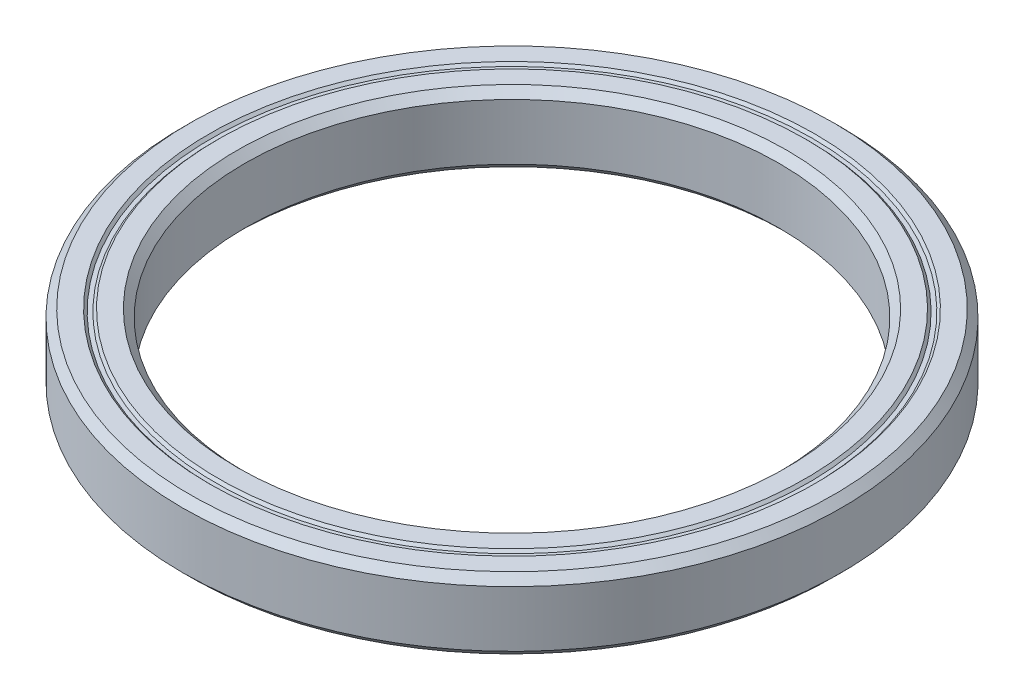
ISO-10303-21;
HEADER;
FILE_DESCRIPTION(('STEP AP214'),'2;1');
FILE_NAME('part.step','',(''),(''),'','','');
FILE_SCHEMA(('AUTOMOTIVE_DESIGN { 1 0 10303 214 1 1 1 1 }'));
ENDSEC;
DATA;
#1=APPLICATION_CONTEXT('core data for automotive mechanical design processes');
#2=APPLICATION_PROTOCOL_DEFINITION('international standard','automotive_design',2000,#1);
#3=PRODUCT_CONTEXT('',#1,'mechanical');
#4=PRODUCT('Part','Part','',(#3));
#5=PRODUCT_RELATED_PRODUCT_CATEGORY('part','',(#4));
#6=PRODUCT_DEFINITION_FORMATION('','',#4);
#7=PRODUCT_DEFINITION_CONTEXT('part definition',#1,'design');
#8=PRODUCT_DEFINITION('design','',#6,#7);
#9=PRODUCT_DEFINITION_SHAPE('','',#8);
#10=(LENGTH_UNIT() NAMED_UNIT(*) SI_UNIT(.MILLI.,.METRE.));
#11=(NAMED_UNIT(*) PLANE_ANGLE_UNIT() SI_UNIT($,.RADIAN.));
#12=(NAMED_UNIT(*) SI_UNIT($,.STERADIAN.) SOLID_ANGLE_UNIT());
#13=UNCERTAINTY_MEASURE_WITH_UNIT(LENGTH_MEASURE(1.E-05),#10,'distance_accuracy_value','');
#14=(GEOMETRIC_REPRESENTATION_CONTEXT(3) GLOBAL_UNCERTAINTY_ASSIGNED_CONTEXT((#13)) GLOBAL_UNIT_ASSIGNED_CONTEXT((#10,
#11,#12)) REPRESENTATION_CONTEXT('',''));
#15=CARTESIAN_POINT('',(0.,0.,0.));
#16=DIRECTION('',(0.,0.,1.));
#17=DIRECTION('',(1.,0.,0.));
#18=AXIS2_PLACEMENT_3D('',#15,#16,#17);
#19=CARTESIAN_POINT('',(0.,1.99999999999999,0.));
#20=DIRECTION('',(0.,1.,0.));
#21=DIRECTION('',(0.,0.,1.));
#22=AXIS2_PLACEMENT_3D('',#19,#20,#21);
#23=CONICAL_SURFACE('',#22,15.4269,0.785398163397461);
#24=CARTESIAN_POINT('',(0.,1.57310000000001,0.));
#25=DIRECTION('',(0.,-1.,0.));
#26=DIRECTION('',(0.,0.,-1.));
#27=AXIS2_PLACEMENT_3D('',#24,#25,#26);
#28=CIRCLE('',#27,15.);
#29=CARTESIAN_POINT('',(0.,1.57310000000001,-15.));
#30=VERTEX_POINT('',#29);
#31=EDGE_CURVE('E10',#30,#30,#28,.T.);
#32=ORIENTED_EDGE('',*,*,#31,.T.);
#33=EDGE_LOOP('',(#32));
#34=FACE_BOUND('',#33,.T.);
#35=CARTESIAN_POINT('',(0.,1.99999999999999,0.));
#36=DIRECTION('',(0.,-1.,0.));
#37=DIRECTION('',(0.,0.,-1.));
#38=AXIS2_PLACEMENT_3D('',#35,#36,#37);
#39=CIRCLE('',#38,15.4269);
#40=CARTESIAN_POINT('',(0.,1.99999999999999,-15.4269));
#41=VERTEX_POINT('',#40);
#42=EDGE_CURVE('E89',#41,#41,#39,.T.);
#43=ORIENTED_EDGE('',*,*,#42,.F.);
#44=EDGE_LOOP('',(#43));
#45=FACE_BOUND('',#44,.T.);
#46=ADVANCED_FACE('F37',(#34,#45),#23,.F.);
#47=CARTESIAN_POINT('',(0.,-1.34942197217015,0.));
#48=DIRECTION('',(0.,-1.,0.));
#49=DIRECTION('',(0.,0.,-1.));
#50=AXIS2_PLACEMENT_3D('',#47,#48,#49);
#51=CYLINDRICAL_SURFACE('',#50,15.);
#52=CARTESIAN_POINT('',(0.,-1.57310000000001,0.));
#53=DIRECTION('',(0.,-1.,0.));
#54=DIRECTION('',(0.,0.,-1.));
#55=AXIS2_PLACEMENT_3D('',#52,#53,#54);
#56=CIRCLE('',#55,15.);
#57=CARTESIAN_POINT('',(0.,-1.57310000000001,-15.));
#58=VERTEX_POINT('',#57);
#59=EDGE_CURVE('E43',#58,#58,#56,.T.);
#60=ORIENTED_EDGE('',*,*,#59,.T.);
#61=EDGE_LOOP('',(#60));
#62=FACE_BOUND('',#61,.T.);
#63=ORIENTED_EDGE('',*,*,#31,.F.);
#64=EDGE_LOOP('',(#63));
#65=FACE_BOUND('',#64,.T.);
#66=ADVANCED_FACE('F97',(#62,#65),#51,.F.);
#67=CARTESIAN_POINT('',(0.,-1.57310000000001,0.));
#68=DIRECTION('',(0.,-1.,0.));
#69=DIRECTION('',(0.,0.,-1.));
#70=AXIS2_PLACEMENT_3D('',#67,#68,#69);
#71=CONICAL_SURFACE('',#70,15.,0.785398163397435);
#72=CARTESIAN_POINT('',(0.,-2.00000000000001,0.));
#73=DIRECTION('',(0.,-1.,0.));
#74=DIRECTION('',(0.,0.,-1.));
#75=AXIS2_PLACEMENT_3D('',#72,#73,#74);
#76=CIRCLE('',#75,15.4269);
#77=CARTESIAN_POINT('',(0.,-2.00000000000001,-15.4269));
#78=VERTEX_POINT('',#77);
#79=EDGE_CURVE('E47',#78,#78,#76,.T.);
#80=ORIENTED_EDGE('',*,*,#79,.T.);
#81=EDGE_LOOP('',(#80));
#82=FACE_BOUND('',#81,.T.);
#83=ORIENTED_EDGE('',*,*,#59,.F.);
#84=EDGE_LOOP('',(#83));
#85=FACE_BOUND('',#84,.T.);
#86=ADVANCED_FACE('F101',(#82,#85),#71,.F.);
#87=CARTESIAN_POINT('',(15.4269,-2.00000000000001,0.));
#88=DIRECTION('',(0.,-1.,0.));
#89=DIRECTION('',(0.,0.,-1.));
#90=AXIS2_PLACEMENT_3D('',#87,#88,#89);
#91=PLANE('',#90);
#92=CARTESIAN_POINT('',(0.,-2.00000000000001,0.));
#93=DIRECTION('',(0.,-1.,0.));
#94=DIRECTION('',(0.,0.,-1.));
#95=AXIS2_PLACEMENT_3D('',#92,#93,#94);
#96=CIRCLE('',#95,16.49415);
#97=CARTESIAN_POINT('',(0.,-2.00000000000001,-16.49415));
#98=VERTEX_POINT('',#97);
#99=EDGE_CURVE('E51',#98,#98,#96,.T.);
#100=ORIENTED_EDGE('',*,*,#99,.T.);
#101=EDGE_LOOP('',(#100));
#102=FACE_BOUND('',#101,.T.);
#103=ORIENTED_EDGE('',*,*,#79,.F.);
#104=EDGE_LOOP('',(#103));
#105=FACE_BOUND('',#104,.T.);
#106=ADVANCED_FACE('F105',(#102,#105),#91,.T.);
#107=CARTESIAN_POINT('',(0.,-2.00000000000001,0.));
#108=DIRECTION('',(0.,1.,0.));
#109=DIRECTION('',(0.,0.,1.));
#110=AXIS2_PLACEMENT_3D('',#107,#108,#109);
#111=CONICAL_SURFACE('',#110,16.49415,0.785398163397464);
#112=CARTESIAN_POINT('',(0.,-1.85770000000001,0.));
#113=DIRECTION('',(0.,-1.,0.));
#114=DIRECTION('',(0.,0.,-1.));
#115=AXIS2_PLACEMENT_3D('',#112,#113,#114);
#116=CIRCLE('',#115,16.63645);
#117=CARTESIAN_POINT('',(0.,-1.85770000000001,-16.63645));
#118=VERTEX_POINT('',#117);
#119=EDGE_CURVE('E56',#118,#118,#116,.T.);
#120=ORIENTED_EDGE('',*,*,#119,.T.);
#121=EDGE_LOOP('',(#120));
#122=FACE_BOUND('',#121,.T.);
#123=ORIENTED_EDGE('',*,*,#99,.F.);
#124=EDGE_LOOP('',(#123));
#125=FACE_BOUND('',#124,.T.);
#126=ADVANCED_FACE('F112',(#122,#125),#111,.T.);
#127=CARTESIAN_POINT('',(16.63645,-1.85770000000001,0.));
#128=DIRECTION('',(0.,-1.,0.));
#129=DIRECTION('',(0.,0.,-1.));
#130=AXIS2_PLACEMENT_3D('',#127,#128,#129);
#131=PLANE('',#130);
#132=CARTESIAN_POINT('',(0.,-1.85770000000001,0.));
#133=DIRECTION('',(0.,-1.,0.));
#134=DIRECTION('',(0.,0.,-1.));
#135=AXIS2_PLACEMENT_3D('',#132,#133,#134);
#136=CIRCLE('',#135,16.86355);
#137=CARTESIAN_POINT('',(0.,-1.85770000000001,-16.86355));
#138=VERTEX_POINT('',#137);
#139=EDGE_CURVE('E59',#138,#138,#136,.T.);
#140=ORIENTED_EDGE('',*,*,#139,.T.);
#141=EDGE_LOOP('',(#140));
#142=FACE_BOUND('',#141,.T.);
#143=ORIENTED_EDGE('',*,*,#119,.F.);
#144=EDGE_LOOP('',(#143));
#145=FACE_BOUND('',#144,.T.);
#146=ADVANCED_FACE('F116',(#142,#145),#131,.T.);
#147=CARTESIAN_POINT('',(0.,-1.85770000000001,0.));
#148=DIRECTION('',(0.,-1.,0.));
#149=DIRECTION('',(0.,0.,-1.));
#150=AXIS2_PLACEMENT_3D('',#147,#148,#149);
#151=CONICAL_SURFACE('',#150,16.86355,0.785398163397446);
#152=CARTESIAN_POINT('',(0.,-2.00000000000001,0.));
#153=DIRECTION('',(0.,-1.,0.));
#154=DIRECTION('',(0.,0.,-1.));
#155=AXIS2_PLACEMENT_3D('',#152,#153,#154);
#156=CIRCLE('',#155,17.00585);
#157=CARTESIAN_POINT('',(0.,-2.00000000000001,-17.00585));
#158=VERTEX_POINT('',#157);
#159=EDGE_CURVE('E62',#158,#158,#156,.T.);
#160=ORIENTED_EDGE('',*,*,#159,.T.);
#161=EDGE_LOOP('',(#160));
#162=FACE_BOUND('',#161,.T.);
#163=ORIENTED_EDGE('',*,*,#139,.F.);
#164=EDGE_LOOP('',(#163));
#165=FACE_BOUND('',#164,.T.);
#166=ADVANCED_FACE('F120',(#162,#165),#151,.F.);
#167=CARTESIAN_POINT('',(17.00585,-2.00000000000001,0.));
#168=DIRECTION('',(0.,-1.,0.));
#169=DIRECTION('',(0.,0.,-1.));
#170=AXIS2_PLACEMENT_3D('',#167,#168,#169);
#171=PLANE('',#170);
#172=CARTESIAN_POINT('',(0.,-2.00000000000001,0.));
#173=DIRECTION('',(0.,-1.,0.));
#174=DIRECTION('',(0.,0.,-1.));
#175=AXIS2_PLACEMENT_3D('',#172,#173,#174);
#176=CIRCLE('',#175,18.0731);
#177=CARTESIAN_POINT('',(0.,-2.00000000000001,-18.0731));
#178=VERTEX_POINT('',#177);
#179=EDGE_CURVE('E65',#178,#178,#176,.T.);
#180=ORIENTED_EDGE('',*,*,#179,.T.);
#181=EDGE_LOOP('',(#180));
#182=FACE_BOUND('',#181,.T.);
#183=ORIENTED_EDGE('',*,*,#159,.F.);
#184=EDGE_LOOP('',(#183));
#185=FACE_BOUND('',#184,.T.);
#186=ADVANCED_FACE('F124',(#182,#185),#171,.T.);
#187=CARTESIAN_POINT('',(0.,-2.00000000000001,0.));
#188=DIRECTION('',(0.,1.,0.));
#189=DIRECTION('',(0.,0.,1.));
#190=AXIS2_PLACEMENT_3D('',#187,#188,#189);
#191=CONICAL_SURFACE('',#190,18.0731,0.78539816339745);
#192=CARTESIAN_POINT('',(0.,-1.57310000000001,0.));
#193=DIRECTION('',(0.,-1.,0.));
#194=DIRECTION('',(0.,0.,-1.));
#195=AXIS2_PLACEMENT_3D('',#192,#193,#194);
#196=CIRCLE('',#195,18.5);
#197=CARTESIAN_POINT('',(0.,-1.57310000000001,-18.5));
#198=VERTEX_POINT('',#197);
#199=EDGE_CURVE('E68',#198,#198,#196,.T.);
#200=ORIENTED_EDGE('',*,*,#199,.T.);
#201=EDGE_LOOP('',(#200));
#202=FACE_BOUND('',#201,.T.);
#203=ORIENTED_EDGE('',*,*,#179,.F.);
#204=EDGE_LOOP('',(#203));
#205=FACE_BOUND('',#204,.T.);
#206=ADVANCED_FACE('F128',(#202,#205),#191,.T.);
#207=CARTESIAN_POINT('',(0.,-1.34942197217015,0.));
#208=DIRECTION('',(0.,-1.,0.));
#209=DIRECTION('',(0.,0.,-1.));
#210=AXIS2_PLACEMENT_3D('',#207,#208,#209);
#211=CYLINDRICAL_SURFACE('',#210,18.5);
#212=CARTESIAN_POINT('',(0.,1.5731,0.));
#213=DIRECTION('',(0.,-1.,0.));
#214=DIRECTION('',(0.,0.,-1.));
#215=AXIS2_PLACEMENT_3D('',#212,#213,#214);
#216=CIRCLE('',#215,18.5);
#217=CARTESIAN_POINT('',(0.,1.5731,-18.5));
#218=VERTEX_POINT('',#217);
#219=EDGE_CURVE('E71',#218,#218,#216,.T.);
#220=ORIENTED_EDGE('',*,*,#219,.T.);
#221=EDGE_LOOP('',(#220));
#222=FACE_BOUND('',#221,.T.);
#223=ORIENTED_EDGE('',*,*,#199,.F.);
#224=EDGE_LOOP('',(#223));
#225=FACE_BOUND('',#224,.T.);
#226=ADVANCED_FACE('F132',(#222,#225),#211,.T.);
#227=CARTESIAN_POINT('',(0.,1.5731,0.));
#228=DIRECTION('',(0.,-1.,0.));
#229=DIRECTION('',(0.,0.,-1.));
#230=AXIS2_PLACEMENT_3D('',#227,#228,#229);
#231=CONICAL_SURFACE('',#230,18.5,0.785398163397444);
#232=CARTESIAN_POINT('',(0.,1.99999999999999,0.));
#233=DIRECTION('',(0.,-1.,0.));
#234=DIRECTION('',(0.,0.,-1.));
#235=AXIS2_PLACEMENT_3D('',#232,#233,#234);
#236=CIRCLE('',#235,18.0731);
#237=CARTESIAN_POINT('',(0.,1.99999999999999,-18.0731));
#238=VERTEX_POINT('',#237);
#239=EDGE_CURVE('E74',#238,#238,#236,.T.);
#240=ORIENTED_EDGE('',*,*,#239,.T.);
#241=EDGE_LOOP('',(#240));
#242=FACE_BOUND('',#241,.T.);
#243=ORIENTED_EDGE('',*,*,#219,.F.);
#244=EDGE_LOOP('',(#243));
#245=FACE_BOUND('',#244,.T.);
#246=ADVANCED_FACE('F136',(#242,#245),#231,.T.);
#247=CARTESIAN_POINT('',(18.0731,1.99999999999999,0.));
#248=DIRECTION('',(0.,1.,0.));
#249=DIRECTION('',(0.,0.,1.));
#250=AXIS2_PLACEMENT_3D('',#247,#248,#249);
#251=PLANE('',#250);
#252=CARTESIAN_POINT('',(0.,1.99999999999999,0.));
#253=DIRECTION('',(0.,-1.,0.));
#254=DIRECTION('',(0.,0.,-1.));
#255=AXIS2_PLACEMENT_3D('',#252,#253,#254);
#256=CIRCLE('',#255,17.00585);
#257=CARTESIAN_POINT('',(0.,1.99999999999999,-17.00585));
#258=VERTEX_POINT('',#257);
#259=EDGE_CURVE('E77',#258,#258,#256,.T.);
#260=ORIENTED_EDGE('',*,*,#259,.T.);
#261=EDGE_LOOP('',(#260));
#262=FACE_BOUND('',#261,.T.);
#263=ORIENTED_EDGE('',*,*,#239,.F.);
#264=EDGE_LOOP('',(#263));
#265=FACE_BOUND('',#264,.T.);
#266=ADVANCED_FACE('F140',(#262,#265),#251,.T.);
#267=CARTESIAN_POINT('',(0.,1.99999999999999,0.));
#268=DIRECTION('',(0.,1.,0.));
#269=DIRECTION('',(0.,0.,1.));
#270=AXIS2_PLACEMENT_3D('',#267,#268,#269);
#271=CONICAL_SURFACE('',#270,17.00585,0.785398163397468);
#272=CARTESIAN_POINT('',(0.,1.85769999999999,0.));
#273=DIRECTION('',(0.,-1.,0.));
#274=DIRECTION('',(0.,0.,-1.));
#275=AXIS2_PLACEMENT_3D('',#272,#273,#274);
#276=CIRCLE('',#275,16.86355);
#277=CARTESIAN_POINT('',(0.,1.85769999999999,-16.86355));
#278=VERTEX_POINT('',#277);
#279=EDGE_CURVE('E80',#278,#278,#276,.T.);
#280=ORIENTED_EDGE('',*,*,#279,.T.);
#281=EDGE_LOOP('',(#280));
#282=FACE_BOUND('',#281,.T.);
#283=ORIENTED_EDGE('',*,*,#259,.F.);
#284=EDGE_LOOP('',(#283));
#285=FACE_BOUND('',#284,.T.);
#286=ADVANCED_FACE('F144',(#282,#285),#271,.F.);
#287=CARTESIAN_POINT('',(16.86355,1.85769999999999,0.));
#288=DIRECTION('',(0.,1.,0.));
#289=DIRECTION('',(0.,0.,1.));
#290=AXIS2_PLACEMENT_3D('',#287,#288,#289);
#291=PLANE('',#290);
#292=CARTESIAN_POINT('',(0.,1.85769999999999,0.));
#293=DIRECTION('',(0.,-1.,0.));
#294=DIRECTION('',(0.,0.,-1.));
#295=AXIS2_PLACEMENT_3D('',#292,#293,#294);
#296=CIRCLE('',#295,16.63645);
#297=CARTESIAN_POINT('',(0.,1.85769999999999,-16.63645));
#298=VERTEX_POINT('',#297);
#299=EDGE_CURVE('E83',#298,#298,#296,.T.);
#300=ORIENTED_EDGE('',*,*,#299,.T.);
#301=EDGE_LOOP('',(#300));
#302=FACE_BOUND('',#301,.T.);
#303=ORIENTED_EDGE('',*,*,#279,.F.);
#304=EDGE_LOOP('',(#303));
#305=FACE_BOUND('',#304,.T.);
#306=ADVANCED_FACE('F148',(#302,#305),#291,.T.);
#307=CARTESIAN_POINT('',(0.,1.85769999999999,0.));
#308=DIRECTION('',(0.,-1.,0.));
#309=DIRECTION('',(0.,0.,-1.));
#310=AXIS2_PLACEMENT_3D('',#307,#308,#309);
#311=CONICAL_SURFACE('',#310,16.63645,0.78539816339743);
#312=CARTESIAN_POINT('',(0.,1.99999999999999,0.));
#313=DIRECTION('',(0.,-1.,0.));
#314=DIRECTION('',(0.,0.,-1.));
#315=AXIS2_PLACEMENT_3D('',#312,#313,#314);
#316=CIRCLE('',#315,16.49415);
#317=CARTESIAN_POINT('',(0.,1.99999999999999,-16.49415));
#318=VERTEX_POINT('',#317);
#319=EDGE_CURVE('E86',#318,#318,#316,.T.);
#320=ORIENTED_EDGE('',*,*,#319,.T.);
#321=EDGE_LOOP('',(#320));
#322=FACE_BOUND('',#321,.T.);
#323=ORIENTED_EDGE('',*,*,#299,.F.);
#324=EDGE_LOOP('',(#323));
#325=FACE_BOUND('',#324,.T.);
#326=ADVANCED_FACE('F152',(#322,#325),#311,.T.);
#327=CARTESIAN_POINT('',(16.49415,1.99999999999999,0.));
#328=DIRECTION('',(0.,1.,0.));
#329=DIRECTION('',(0.,0.,1.));
#330=AXIS2_PLACEMENT_3D('',#327,#328,#329);
#331=PLANE('',#330);
#332=ORIENTED_EDGE('',*,*,#42,.T.);
#333=EDGE_LOOP('',(#332));
#334=FACE_BOUND('',#333,.T.);
#335=ORIENTED_EDGE('',*,*,#319,.F.);
#336=EDGE_LOOP('',(#335));
#337=FACE_BOUND('',#336,.T.);
#338=ADVANCED_FACE('F93',(#334,#337),#331,.T.);
#339=CLOSED_SHELL('',(#46,#66,#86,#106,#126,#146,#166,#186,#206,#226,#246,#266,#286,#306,#326,#338));
#340=MANIFOLD_SOLID_BREP('B2',#339);
#341=ADVANCED_BREP_SHAPE_REPRESENTATION('',(#18,#340),#14);
#342=SHAPE_DEFINITION_REPRESENTATION(#9,#341);
ENDSEC;
END-ISO-10303-21;
